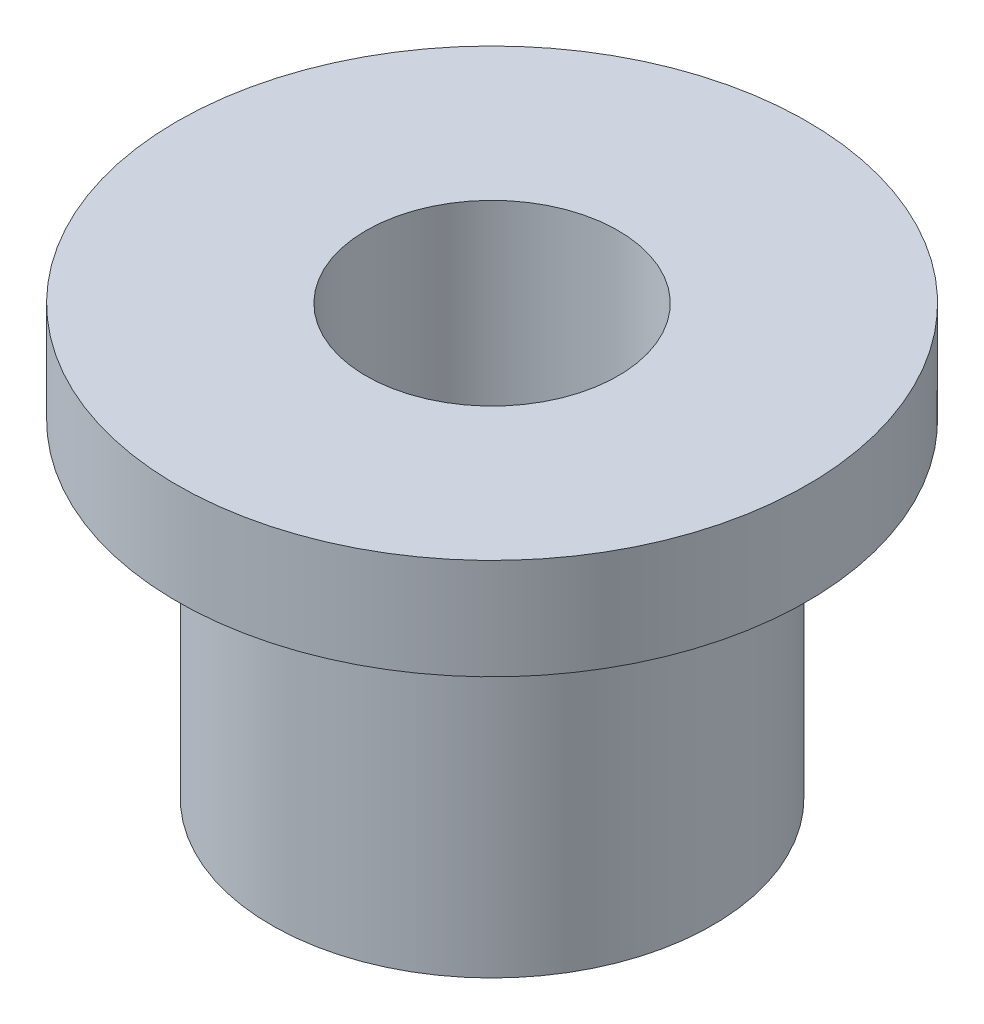
ISO-10303-21;
HEADER;
FILE_DESCRIPTION(('STEP AP214'),'2;1');
FILE_NAME('part.step','',(''),(''),'','','');
FILE_SCHEMA(('AUTOMOTIVE_DESIGN { 1 0 10303 214 1 1 1 1 }'));
ENDSEC;
DATA;
#1=APPLICATION_CONTEXT('core data for automotive mechanical design processes');
#2=APPLICATION_PROTOCOL_DEFINITION('international standard','automotive_design',2000,#1);
#3=PRODUCT_CONTEXT('',#1,'mechanical');
#4=PRODUCT('Part','Part','',(#3));
#5=PRODUCT_RELATED_PRODUCT_CATEGORY('part','',(#4));
#6=PRODUCT_DEFINITION_FORMATION('','',#4);
#7=PRODUCT_DEFINITION_CONTEXT('part definition',#1,'design');
#8=PRODUCT_DEFINITION('design','',#6,#7);
#9=PRODUCT_DEFINITION_SHAPE('','',#8);
#10=(LENGTH_UNIT() NAMED_UNIT(*) SI_UNIT(.MILLI.,.METRE.));
#11=(NAMED_UNIT(*) PLANE_ANGLE_UNIT() SI_UNIT($,.RADIAN.));
#12=(NAMED_UNIT(*) SI_UNIT($,.STERADIAN.) SOLID_ANGLE_UNIT());
#13=UNCERTAINTY_MEASURE_WITH_UNIT(LENGTH_MEASURE(1.E-05),#10,'distance_accuracy_value','');
#14=(GEOMETRIC_REPRESENTATION_CONTEXT(3) GLOBAL_UNCERTAINTY_ASSIGNED_CONTEXT((#13)) GLOBAL_UNIT_ASSIGNED_CONTEXT((#10,
#11,#12)) REPRESENTATION_CONTEXT('',''));
#15=CARTESIAN_POINT('',(0.,0.,0.));
#16=DIRECTION('',(0.,0.,1.));
#17=DIRECTION('',(1.,0.,0.));
#18=AXIS2_PLACEMENT_3D('',#15,#16,#17);
#19=CARTESIAN_POINT('',(0.,0.,0.));
#20=DIRECTION('',(0.,1.,0.));
#21=DIRECTION('',(-1.,0.,0.));
#22=AXIS2_PLACEMENT_3D('',#19,#20,#21);
#23=PLANE('',#22);
#24=CARTESIAN_POINT('',(0.,0.,0.));
#25=DIRECTION('',(0.,1.,0.));
#26=DIRECTION('',(-1.,0.,0.));
#27=AXIS2_PLACEMENT_3D('',#24,#25,#26);
#28=CIRCLE('',#27,10.);
#29=CARTESIAN_POINT('',(-10.,0.,0.));
#30=VERTEX_POINT('',#29);
#31=EDGE_CURVE('E50',#30,#30,#28,.F.);
#32=ORIENTED_EDGE('',*,*,#31,.F.);
#33=EDGE_LOOP('',(#32));
#34=FACE_BOUND('',#33,.T.);
#35=CARTESIAN_POINT('',(0.,0.,0.));
#36=DIRECTION('',(0.,1.,0.));
#37=DIRECTION('',(-1.,0.,0.));
#38=AXIS2_PLACEMENT_3D('',#35,#36,#37);
#39=CIRCLE('',#38,17.5);
#40=CARTESIAN_POINT('',(-17.5,0.,0.));
#41=VERTEX_POINT('',#40);
#42=EDGE_CURVE('E10',#41,#41,#39,.T.);
#43=ORIENTED_EDGE('',*,*,#42,.F.);
#44=EDGE_LOOP('',(#43));
#45=FACE_BOUND('',#44,.T.);
#46=ADVANCED_FACE('F31',(#34,#45),#23,.F.);
#47=CARTESIAN_POINT('',(0.,34.0309600028775,0.));
#48=DIRECTION('',(0.,1.,0.));
#49=DIRECTION('',(-1.,0.,0.));
#50=AXIS2_PLACEMENT_3D('',#47,#48,#49);
#51=CYLINDRICAL_SURFACE('',#50,17.5);
#52=CARTESIAN_POINT('',(0.,26.,0.));
#53=DIRECTION('',(0.,1.,0.));
#54=DIRECTION('',(-1.,0.,0.));
#55=AXIS2_PLACEMENT_3D('',#52,#53,#54);
#56=CIRCLE('',#55,17.5);
#57=CARTESIAN_POINT('',(-17.5,26.,0.));
#58=VERTEX_POINT('',#57);
#59=EDGE_CURVE('E37',#58,#58,#56,.T.);
#60=ORIENTED_EDGE('',*,*,#59,.F.);
#61=EDGE_LOOP('',(#60));
#62=FACE_BOUND('',#61,.T.);
#63=ORIENTED_EDGE('',*,*,#42,.T.);
#64=EDGE_LOOP('',(#63));
#65=FACE_BOUND('',#64,.T.);
#66=ADVANCED_FACE('F74',(#62,#65),#51,.T.);
#67=CARTESIAN_POINT('',(17.5,26.,0.));
#68=DIRECTION('',(0.,1.,0.));
#69=DIRECTION('',(-1.,0.,0.));
#70=AXIS2_PLACEMENT_3D('',#67,#68,#69);
#71=PLANE('',#70);
#72=CARTESIAN_POINT('',(0.,26.,0.));
#73=DIRECTION('',(0.,1.,0.));
#74=DIRECTION('',(-1.,0.,0.));
#75=AXIS2_PLACEMENT_3D('',#72,#73,#74);
#76=CIRCLE('',#75,25.);
#77=CARTESIAN_POINT('',(-25.,26.,0.));
#78=VERTEX_POINT('',#77);
#79=EDGE_CURVE('E41',#78,#78,#76,.T.);
#80=ORIENTED_EDGE('',*,*,#79,.F.);
#81=EDGE_LOOP('',(#80));
#82=FACE_BOUND('',#81,.T.);
#83=ORIENTED_EDGE('',*,*,#59,.T.);
#84=EDGE_LOOP('',(#83));
#85=FACE_BOUND('',#84,.T.);
#86=ADVANCED_FACE('F69',(#82,#85),#71,.F.);
#87=CARTESIAN_POINT('',(0.,34.0309600028775,0.));
#88=DIRECTION('',(0.,1.,0.));
#89=DIRECTION('',(-1.,0.,0.));
#90=AXIS2_PLACEMENT_3D('',#87,#88,#89);
#91=CYLINDRICAL_SURFACE('',#90,25.);
#92=CARTESIAN_POINT('',(0.,34.,0.));
#93=DIRECTION('',(0.,1.,0.));
#94=DIRECTION('',(-1.,0.,0.));
#95=AXIS2_PLACEMENT_3D('',#92,#93,#94);
#96=CIRCLE('',#95,25.);
#97=CARTESIAN_POINT('',(-25.,34.,0.));
#98=VERTEX_POINT('',#97);
#99=EDGE_CURVE('E45',#98,#98,#96,.T.);
#100=ORIENTED_EDGE('',*,*,#99,.F.);
#101=EDGE_LOOP('',(#100));
#102=FACE_BOUND('',#101,.T.);
#103=ORIENTED_EDGE('',*,*,#79,.T.);
#104=EDGE_LOOP('',(#103));
#105=FACE_BOUND('',#104,.T.);
#106=ADVANCED_FACE('F63',(#102,#105),#91,.T.);
#107=CARTESIAN_POINT('',(25.,34.,0.));
#108=DIRECTION('',(0.,-1.,0.));
#109=DIRECTION('',(1.,0.,0.));
#110=AXIS2_PLACEMENT_3D('',#107,#108,#109);
#111=PLANE('',#110);
#112=CARTESIAN_POINT('',(0.,34.,0.));
#113=DIRECTION('',(0.,1.,0.));
#114=DIRECTION('',(-1.,0.,0.));
#115=AXIS2_PLACEMENT_3D('',#112,#113,#114);
#116=CIRCLE('',#115,10.);
#117=CARTESIAN_POINT('',(-10.,34.,0.));
#118=VERTEX_POINT('',#117);
#119=EDGE_CURVE('E53',#118,#118,#116,.T.);
#120=ORIENTED_EDGE('',*,*,#119,.F.);
#121=EDGE_LOOP('',(#120));
#122=FACE_BOUND('',#121,.T.);
#123=ORIENTED_EDGE('',*,*,#99,.T.);
#124=EDGE_LOOP('',(#123));
#125=FACE_BOUND('',#124,.T.);
#126=ADVANCED_FACE('F60',(#122,#125),#111,.F.);
#127=CARTESIAN_POINT('',(0.,-0.00100000000002876,0.));
#128=DIRECTION('',(0.,1.,0.));
#129=DIRECTION('',(-1.,0.,0.));
#130=AXIS2_PLACEMENT_3D('',#127,#128,#129);
#131=CYLINDRICAL_SURFACE('',#130,10.);
#132=ORIENTED_EDGE('',*,*,#119,.T.);
#133=EDGE_LOOP('',(#132));
#134=FACE_BOUND('',#133,.T.);
#135=ORIENTED_EDGE('',*,*,#31,.T.);
#136=EDGE_LOOP('',(#135));
#137=FACE_BOUND('',#136,.T.);
#138=ADVANCED_FACE('F57',(#134,#137),#131,.F.);
#139=CLOSED_SHELL('',(#46,#66,#86,#106,#126,#138));
#140=MANIFOLD_SOLID_BREP('B2',#139);
#141=ADVANCED_BREP_SHAPE_REPRESENTATION('',(#18,#140),#14);
#142=SHAPE_DEFINITION_REPRESENTATION(#9,#141);
ENDSEC;
END-ISO-10303-21;
